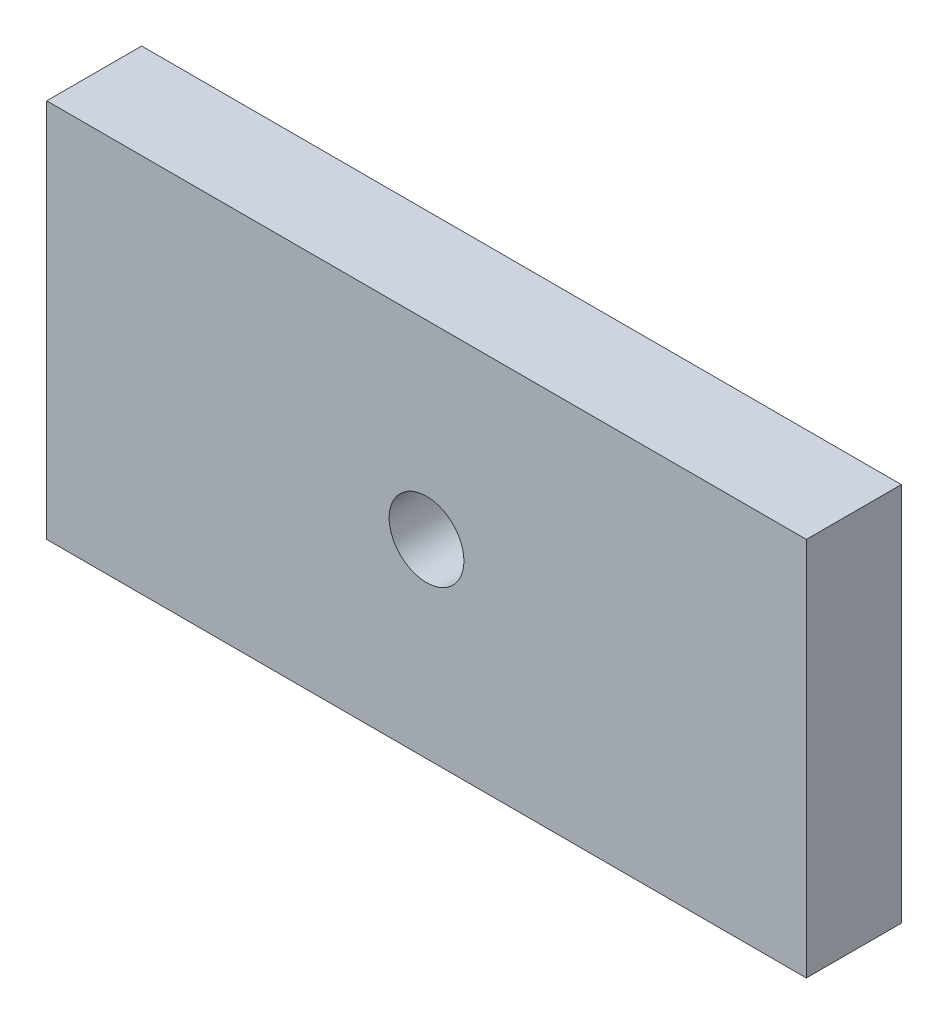
ISO-10303-21;
HEADER;
FILE_DESCRIPTION(('STEP AP214'),'2;1');
FILE_NAME('part.step','',(''),(''),'','','');
FILE_SCHEMA(('AUTOMOTIVE_DESIGN { 1 0 10303 214 1 1 1 1 }'));
ENDSEC;
DATA;
#1=APPLICATION_CONTEXT('core data for automotive mechanical design processes');
#2=APPLICATION_PROTOCOL_DEFINITION('international standard','automotive_design',2000,#1);
#3=PRODUCT_CONTEXT('',#1,'mechanical');
#4=PRODUCT('Part','Part','',(#3));
#5=PRODUCT_RELATED_PRODUCT_CATEGORY('part','',(#4));
#6=PRODUCT_DEFINITION_FORMATION('','',#4);
#7=PRODUCT_DEFINITION_CONTEXT('part definition',#1,'design');
#8=PRODUCT_DEFINITION('design','',#6,#7);
#9=PRODUCT_DEFINITION_SHAPE('','',#8);
#10=(LENGTH_UNIT() NAMED_UNIT(*) SI_UNIT(.MILLI.,.METRE.));
#11=(NAMED_UNIT(*) PLANE_ANGLE_UNIT() SI_UNIT($,.RADIAN.));
#12=(NAMED_UNIT(*) SI_UNIT($,.STERADIAN.) SOLID_ANGLE_UNIT());
#13=UNCERTAINTY_MEASURE_WITH_UNIT(LENGTH_MEASURE(1.E-05),#10,'distance_accuracy_value','');
#14=(GEOMETRIC_REPRESENTATION_CONTEXT(3) GLOBAL_UNCERTAINTY_ASSIGNED_CONTEXT((#13)) GLOBAL_UNIT_ASSIGNED_CONTEXT((#10,
#11,#12)) REPRESENTATION_CONTEXT('',''));
#15=CARTESIAN_POINT('',(0.,0.,0.));
#16=DIRECTION('',(0.,0.,1.));
#17=DIRECTION('',(1.,0.,0.));
#18=AXIS2_PLACEMENT_3D('',#15,#16,#17);
#19=CARTESIAN_POINT('',(76.2,0.,9.525));
#20=DIRECTION('',(1.,0.,0.));
#21=DIRECTION('',(0.,0.,-1.));
#22=AXIS2_PLACEMENT_3D('',#19,#20,#21);
#23=PLANE('',#22);
#24=DIRECTION('',(0.,-1.,0.));
#25=VECTOR('',#24,1.);
#26=CARTESIAN_POINT('',(76.2,0.,0.));
#27=LINE('',#26,#25);
#28=CARTESIAN_POINT('',(76.2,0.,0.));
#29=VERTEX_POINT('',#28);
#30=CARTESIAN_POINT('',(76.2,-38.1,0.));
#31=VERTEX_POINT('',#30);
#32=EDGE_CURVE('E113',#29,#31,#27,.T.);
#33=ORIENTED_EDGE('',*,*,#32,.F.);
#34=DIRECTION('',(0.,0.,-1.));
#35=VECTOR('',#34,1.);
#36=CARTESIAN_POINT('',(76.2,0.,9.525));
#37=LINE('',#36,#35);
#38=CARTESIAN_POINT('',(76.2,0.,9.525));
#39=VERTEX_POINT('',#38);
#40=EDGE_CURVE('E11',#39,#29,#37,.T.);
#41=ORIENTED_EDGE('',*,*,#40,.F.);
#42=DIRECTION('',(0.,-1.,0.));
#43=VECTOR('',#42,1.);
#44=CARTESIAN_POINT('',(76.2,0.,9.525));
#45=LINE('',#44,#43);
#46=CARTESIAN_POINT('',(76.2,-38.1,9.525));
#47=VERTEX_POINT('',#46);
#48=EDGE_CURVE('E100',#39,#47,#45,.T.);
#49=ORIENTED_EDGE('',*,*,#48,.T.);
#50=DIRECTION('',(0.,0.,-1.));
#51=VECTOR('',#50,1.);
#52=CARTESIAN_POINT('',(76.2,-38.1,9.525));
#53=LINE('',#52,#51);
#54=EDGE_CURVE('E78',#47,#31,#53,.T.);
#55=ORIENTED_EDGE('',*,*,#54,.T.);
#56=EDGE_LOOP('',(#33,#41,#49,#55));
#57=FACE_BOUND('',#56,.T.);
#58=ADVANCED_FACE('F39',(#57),#23,.T.);
#59=CARTESIAN_POINT('',(0.,0.,9.525));
#60=DIRECTION('',(0.,1.,0.));
#61=DIRECTION('',(0.,0.,1.));
#62=AXIS2_PLACEMENT_3D('',#59,#60,#61);
#63=PLANE('',#62);
#64=DIRECTION('',(1.,0.,0.));
#65=VECTOR('',#64,1.);
#66=CARTESIAN_POINT('',(0.,0.,0.));
#67=LINE('',#66,#65);
#68=CARTESIAN_POINT('',(0.,0.,0.));
#69=VERTEX_POINT('',#68);
#70=EDGE_CURVE('E91',#69,#29,#67,.T.);
#71=ORIENTED_EDGE('',*,*,#70,.F.);
#72=DIRECTION('',(0.,0.,-1.));
#73=VECTOR('',#72,1.);
#74=CARTESIAN_POINT('',(0.,0.,9.525));
#75=LINE('',#74,#73);
#76=CARTESIAN_POINT('',(0.,0.,9.525));
#77=VERTEX_POINT('',#76);
#78=EDGE_CURVE('E48',#77,#69,#75,.T.);
#79=ORIENTED_EDGE('',*,*,#78,.F.);
#80=DIRECTION('',(1.,0.,0.));
#81=VECTOR('',#80,1.);
#82=CARTESIAN_POINT('',(0.,0.,9.525));
#83=LINE('',#82,#81);
#84=EDGE_CURVE('E89',#77,#39,#83,.T.);
#85=ORIENTED_EDGE('',*,*,#84,.T.);
#86=ORIENTED_EDGE('',*,*,#40,.T.);
#87=EDGE_LOOP('',(#71,#79,#85,#86));
#88=FACE_BOUND('',#87,.T.);
#89=ADVANCED_FACE('F87',(#88),#63,.T.);
#90=CARTESIAN_POINT('',(0.,0.,9.525));
#91=DIRECTION('',(1.,0.,0.));
#92=DIRECTION('',(0.,0.,-1.));
#93=AXIS2_PLACEMENT_3D('',#90,#91,#92);
#94=PLANE('',#93);
#95=DIRECTION('',(0.,-1.,0.));
#96=VECTOR('',#95,1.);
#97=CARTESIAN_POINT('',(0.,0.,0.));
#98=LINE('',#97,#96);
#99=CARTESIAN_POINT('',(0.,-38.1,0.));
#100=VERTEX_POINT('',#99);
#101=EDGE_CURVE('E71',#69,#100,#98,.T.);
#102=ORIENTED_EDGE('',*,*,#101,.T.);
#103=DIRECTION('',(0.,0.,-1.));
#104=VECTOR('',#103,1.);
#105=CARTESIAN_POINT('',(0.,-38.1,9.525));
#106=LINE('',#105,#104);
#107=CARTESIAN_POINT('',(0.,-38.1,9.525));
#108=VERTEX_POINT('',#107);
#109=EDGE_CURVE('E93',#108,#100,#106,.T.);
#110=ORIENTED_EDGE('',*,*,#109,.F.);
#111=DIRECTION('',(0.,-1.,0.));
#112=VECTOR('',#111,1.);
#113=CARTESIAN_POINT('',(0.,0.,9.525));
#114=LINE('',#113,#112);
#115=EDGE_CURVE('E94',#77,#108,#114,.T.);
#116=ORIENTED_EDGE('',*,*,#115,.F.);
#117=ORIENTED_EDGE('',*,*,#78,.T.);
#118=EDGE_LOOP('',(#102,#110,#116,#117));
#119=FACE_BOUND('',#118,.T.);
#120=ADVANCED_FACE('F95',(#119),#94,.F.);
#121=CARTESIAN_POINT('',(0.,-38.1,9.525));
#122=DIRECTION('',(0.,1.,0.));
#123=DIRECTION('',(0.,0.,1.));
#124=AXIS2_PLACEMENT_3D('',#121,#122,#123);
#125=PLANE('',#124);
#126=DIRECTION('',(1.,0.,0.));
#127=VECTOR('',#126,1.);
#128=CARTESIAN_POINT('',(0.,-38.1,0.));
#129=LINE('',#128,#127);
#130=EDGE_CURVE('E121',#100,#31,#129,.T.);
#131=ORIENTED_EDGE('',*,*,#130,.T.);
#132=ORIENTED_EDGE('',*,*,#54,.F.);
#133=DIRECTION('',(1.,0.,0.));
#134=VECTOR('',#133,1.);
#135=CARTESIAN_POINT('',(0.,-38.1,9.525));
#136=LINE('',#135,#134);
#137=EDGE_CURVE('E56',#108,#47,#136,.T.);
#138=ORIENTED_EDGE('',*,*,#137,.F.);
#139=ORIENTED_EDGE('',*,*,#109,.T.);
#140=EDGE_LOOP('',(#131,#132,#138,#139));
#141=FACE_BOUND('',#140,.T.);
#142=ADVANCED_FACE('F132',(#141),#125,.F.);
#143=CARTESIAN_POINT('',(38.1,-19.05,9.525));
#144=DIRECTION('',(0.,0.,-1.));
#145=DIRECTION('',(-1.,0.,0.));
#146=AXIS2_PLACEMENT_3D('',#143,#144,#145);
#147=CYLINDRICAL_SURFACE('',#146,3.75);
#148=CARTESIAN_POINT('',(38.1,-19.05,9.525));
#149=DIRECTION('',(0.,0.,1.));
#150=DIRECTION('',(1.,0.,0.));
#151=AXIS2_PLACEMENT_3D('',#148,#149,#150);
#152=CIRCLE('',#151,3.75);
#153=CARTESIAN_POINT('',(41.85,-19.05,9.525));
#154=VERTEX_POINT('',#153);
#155=EDGE_CURVE('E109',#154,#154,#152,.T.);
#156=ORIENTED_EDGE('',*,*,#155,.T.);
#157=EDGE_LOOP('',(#156));
#158=FACE_BOUND('',#157,.T.);
#159=CARTESIAN_POINT('',(38.1,-19.05,0.));
#160=DIRECTION('',(0.,0.,1.));
#161=DIRECTION('',(1.,0.,0.));
#162=AXIS2_PLACEMENT_3D('',#159,#160,#161);
#163=CIRCLE('',#162,3.75);
#164=CARTESIAN_POINT('',(41.85,-19.05,0.));
#165=VERTEX_POINT('',#164);
#166=EDGE_CURVE('E104',#165,#165,#163,.T.);
#167=ORIENTED_EDGE('',*,*,#166,.F.);
#168=EDGE_LOOP('',(#167));
#169=FACE_BOUND('',#168,.T.);
#170=ADVANCED_FACE('F147',(#158,#169),#147,.F.);
#171=CARTESIAN_POINT('',(0.,0.,9.525));
#172=DIRECTION('',(0.,0.,1.));
#173=DIRECTION('',(1.,0.,0.));
#174=AXIS2_PLACEMENT_3D('',#171,#172,#173);
#175=PLANE('',#174);
#176=ORIENTED_EDGE('',*,*,#48,.F.);
#177=ORIENTED_EDGE('',*,*,#84,.F.);
#178=ORIENTED_EDGE('',*,*,#115,.T.);
#179=ORIENTED_EDGE('',*,*,#137,.T.);
#180=EDGE_LOOP('',(#176,#177,#178,#179));
#181=FACE_BOUND('',#180,.T.);
#182=ORIENTED_EDGE('',*,*,#155,.F.);
#183=EDGE_LOOP('',(#182));
#184=FACE_BOUND('',#183,.T.);
#185=ADVANCED_FACE('F98',(#181,#184),#175,.T.);
#186=CARTESIAN_POINT('',(0.,0.,0.));
#187=DIRECTION('',(0.,0.,1.));
#188=DIRECTION('',(1.,0.,0.));
#189=AXIS2_PLACEMENT_3D('',#186,#187,#188);
#190=PLANE('',#189);
#191=ORIENTED_EDGE('',*,*,#32,.T.);
#192=ORIENTED_EDGE('',*,*,#130,.F.);
#193=ORIENTED_EDGE('',*,*,#101,.F.);
#194=ORIENTED_EDGE('',*,*,#70,.T.);
#195=EDGE_LOOP('',(#191,#192,#193,#194));
#196=FACE_BOUND('',#195,.T.);
#197=ORIENTED_EDGE('',*,*,#166,.T.);
#198=EDGE_LOOP('',(#197));
#199=FACE_BOUND('',#198,.T.);
#200=ADVANCED_FACE('F134',(#196,#199),#190,.F.);
#201=CLOSED_SHELL('',(#58,#89,#120,#142,#170,#185,#200));
#202=MANIFOLD_SOLID_BREP('B2',#201);
#203=ADVANCED_BREP_SHAPE_REPRESENTATION('',(#18,#202),#14);
#204=SHAPE_DEFINITION_REPRESENTATION(#9,#203);
ENDSEC;
END-ISO-10303-21;
